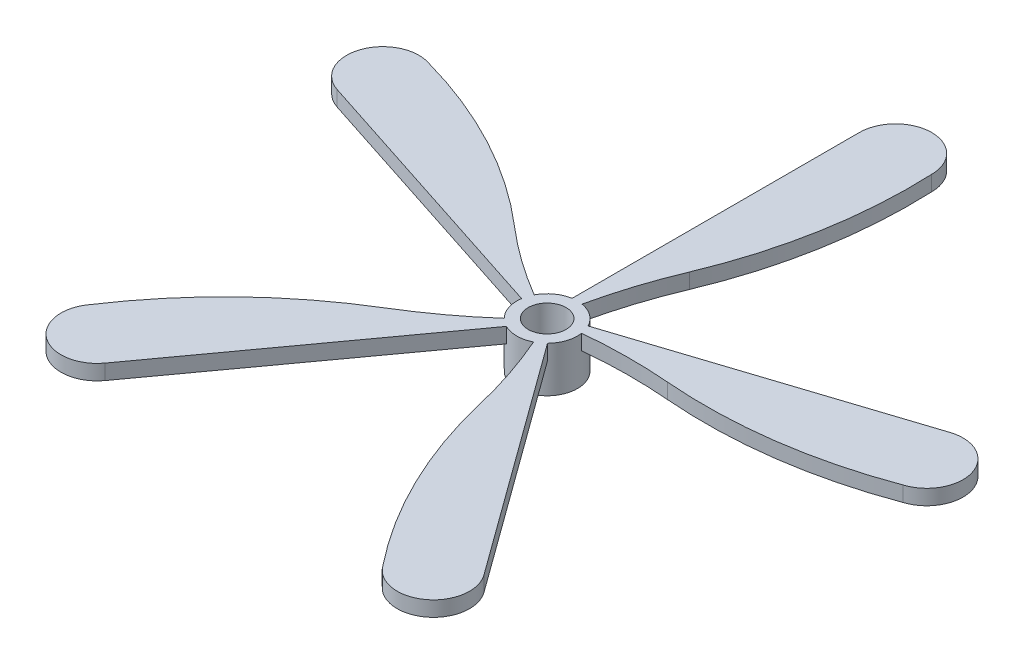
ISO-10303-21;
HEADER;
FILE_DESCRIPTION(('STEP AP214'),'2;1');
FILE_NAME('part.step','',(''),(''),'','','');
FILE_SCHEMA(('AUTOMOTIVE_DESIGN { 1 0 10303 214 1 1 1 1 }'));
ENDSEC;
DATA;
#1=APPLICATION_CONTEXT('core data for automotive mechanical design processes');
#2=APPLICATION_PROTOCOL_DEFINITION('international standard','automotive_design',2000,#1);
#3=PRODUCT_CONTEXT('',#1,'mechanical');
#4=PRODUCT('Part','Part','',(#3));
#5=PRODUCT_RELATED_PRODUCT_CATEGORY('part','',(#4));
#6=PRODUCT_DEFINITION_FORMATION('','',#4);
#7=PRODUCT_DEFINITION_CONTEXT('part definition',#1,'design');
#8=PRODUCT_DEFINITION('design','',#6,#7);
#9=PRODUCT_DEFINITION_SHAPE('','',#8);
#10=(LENGTH_UNIT() NAMED_UNIT(*) SI_UNIT(.MILLI.,.METRE.));
#11=(NAMED_UNIT(*) PLANE_ANGLE_UNIT() SI_UNIT($,.RADIAN.));
#12=(NAMED_UNIT(*) SI_UNIT($,.STERADIAN.) SOLID_ANGLE_UNIT());
#13=UNCERTAINTY_MEASURE_WITH_UNIT(LENGTH_MEASURE(1.E-05),#10,'distance_accuracy_value','');
#14=(GEOMETRIC_REPRESENTATION_CONTEXT(3) GLOBAL_UNCERTAINTY_ASSIGNED_CONTEXT((#13)) GLOBAL_UNIT_ASSIGNED_CONTEXT((#10,
#11,#12)) REPRESENTATION_CONTEXT('',''));
#15=CARTESIAN_POINT('',(0.,0.,0.));
#16=DIRECTION('',(0.,0.,1.));
#17=DIRECTION('',(1.,0.,0.));
#18=AXIS2_PLACEMENT_3D('',#15,#16,#17);
#19=CARTESIAN_POINT('',(0.,6.,0.));
#20=DIRECTION('',(0.,1.,0.));
#21=DIRECTION('',(0.,0.,1.));
#22=AXIS2_PLACEMENT_3D('',#19,#20,#21);
#23=PLANE('',#22);
#24=CARTESIAN_POINT('',(0.,6.,0.));
#25=DIRECTION('',(0.,1.,0.));
#26=DIRECTION('',(0.,0.,1.));
#27=AXIS2_PLACEMENT_3D('',#24,#25,#26);
#28=CIRCLE('',#27,4.);
#29=CARTESIAN_POINT('',(-0.65939763403977,6.,-3.94527499171132));
#30=VERTEX_POINT('',#29);
#31=CARTESIAN_POINT('',(-3.54841441447447,6.,-1.84628143660442));
#32=VERTEX_POINT('',#31);
#33=EDGE_CURVE('E11',#30,#32,#28,.T.);
#34=ORIENTED_EDGE('',*,*,#33,.T.);
#35=CARTESIAN_POINT('',(28.3133843807935,6.,-56.0535189617513));
#36=DIRECTION('',(0.,-1.,0.));
#37=DIRECTION('',(0.951056516295155,0.,0.309016994374945));
#38=AXIS2_PLACEMENT_3D('',#35,#36,#37);
#39=CIRCLE('',#38,62.8776496266983);
#40=CARTESIAN_POINT('',(-12.7002363605592,6.,-8.39345458640333));
#41=VERTEX_POINT('',#40);
#42=EDGE_CURVE('E315',#32,#41,#39,.T.);
#43=ORIENTED_EDGE('',*,*,#42,.T.);
#44=CARTESIAN_POINT('',(-53.78297853576,6.,39.346932665281));
#45=DIRECTION('',(0.,1.,0.));
#46=DIRECTION('',(-0.951056516295155,0.,-0.309016994374945));
#47=AXIS2_PLACEMENT_3D('',#44,#45,#46);
#48=CIRCLE('',#47,62.9836191368423);
#49=CARTESIAN_POINT('',(-36.9640956294667,6.,-21.349537226791));
#50=VERTEX_POINT('',#49);
#51=EDGE_CURVE('E343',#41,#50,#48,.T.);
#52=ORIENTED_EDGE('',*,*,#51,.T.);
#53=CARTESIAN_POINT('',(-38.4873725052939,6.,-16.8283735232392));
#54=DIRECTION('',(0.,1.,0.));
#55=DIRECTION('',(-0.951056516295155,0.,-0.309016994374945));
#56=AXIS2_PLACEMENT_3D('',#53,#54,#55);
#57=CIRCLE('',#56,4.7708797589904);
#58=CARTESIAN_POINT('',(-39.9616554289414,6.,-12.2909972399907));
#59=VERTEX_POINT('',#58);
#60=EDGE_CURVE('E346',#50,#59,#57,.T.);
#61=ORIENTED_EDGE('',*,*,#60,.T.);
#62=DIRECTION('',(0.951056516295155,0.,0.309016994374945));
#63=VECTOR('',#62,1.);
#64=CARTESIAN_POINT('',(-3.95594456441228,6.,-0.592032603238136));
#65=LINE('',#64,#63);
#66=CARTESIAN_POINT('',(-3.95594456441228,6.,-0.592032603238136));
#67=VERTEX_POINT('',#66);
#68=EDGE_CURVE('E328',#59,#67,#65,.T.);
#69=ORIENTED_EDGE('',*,*,#68,.T.);
#70=CARTESIAN_POINT('',(-2.85243834835505,6.,2.80421031109185));
#71=VERTEX_POINT('',#70);
#72=EDGE_CURVE('E42',#67,#71,#28,.T.);
#73=ORIENTED_EDGE('',*,*,#72,.T.);
#74=CARTESIAN_POINT('',(-44.5607475279122,6.,-44.2491186674225));
#75=DIRECTION('',(0.,-1.,0.));
#76=DIRECTION('',(0.587785252292469,0.,-0.809016994374951));
#77=AXIS2_PLACEMENT_3D('',#74,#75,#76);
#78=CIRCLE('',#77,62.8776496266983);
#79=CARTESIAN_POINT('',(-11.9072385466177,6.,9.48492244048556));
#80=VERTEX_POINT('',#79);
#81=EDGE_CURVE('E277',#71,#80,#78,.T.);
#82=ORIENTED_EDGE('',*,*,#81,.T.);
#83=CARTESIAN_POINT('',(20.8013023318894,6.,63.3095230722955));
#84=DIRECTION('',(0.,1.,0.));
#85=DIRECTION('',(-0.587785252292469,0.,0.809016994374951));
#86=AXIS2_PLACEMENT_3D('',#83,#84,#85);
#87=CIRCLE('',#86,62.9836191368423);
#88=CARTESIAN_POINT('',(-31.7271502306314,6.,28.5575741922426));
#89=VERTEX_POINT('',#88);
#90=EDGE_CURVE('E305',#80,#89,#87,.T.);
#91=ORIENTED_EDGE('',*,*,#90,.T.);
#92=CARTESIAN_POINT('',(-27.8979864709003,6.,31.4034130098685));
#93=DIRECTION('',(0.,1.,0.));
#94=DIRECTION('',(-0.587785252292469,0.,0.809016994374951));
#95=AXIS2_PLACEMENT_3D('',#92,#93,#94);
#96=CIRCLE('',#95,4.7708797589904);
#97=CARTESIAN_POINT('',(-24.0382636677576,6.,34.2076657726637));
#98=VERTEX_POINT('',#97);
#99=EDGE_CURVE('E308',#89,#98,#96,.T.);
#100=ORIENTED_EDGE('',*,*,#99,.T.);
#101=DIRECTION('',(0.587785252292469,0.,-0.809016994374951));
#102=VECTOR('',#101,1.);
#103=CARTESIAN_POINT('',(-1.7855105643774,6.,3.57937872046207));
#104=LINE('',#103,#102);
#105=CARTESIAN_POINT('',(-1.7855105643774,6.,3.57937872046207));
#106=VERTEX_POINT('',#105);
#107=EDGE_CURVE('E290',#98,#106,#104,.T.);
#108=ORIENTED_EDGE('',*,*,#107,.T.);
#109=CARTESIAN_POINT('',(1.78551056437746,6.,3.57937872046209));
#110=VERTEX_POINT('',#109);
#111=EDGE_CURVE('E451',#106,#110,#28,.T.);
#112=ORIENTED_EDGE('',*,*,#111,.T.);
#113=CARTESIAN_POINT('',(-55.8534409171459,6.,28.706059653057));
#114=DIRECTION('',(0.,-1.,0.));
#115=DIRECTION('',(-0.58778525229248,0.,-0.809016994374942));
#116=AXIS2_PLACEMENT_3D('',#113,#114,#115);
#117=CIRCLE('',#116,62.8776496266983);
#118=CARTESIAN_POINT('',(5.34115822659664,6.,14.25545903528));
#119=VERTEX_POINT('',#118);
#120=EDGE_CURVE('E245',#110,#119,#117,.T.);
#121=ORIENTED_EDGE('',*,*,#120,.T.);
#122=CARTESIAN_POINT('',(66.63889038713,6.,-0.21949559505708));
#123=DIRECTION('',(0.,1.,0.));
#124=DIRECTION('',(0.58778525229248,0.,0.809016994374942));
#125=AXIS2_PLACEMENT_3D('',#122,#123,#124);
#126=CIRCLE('',#125,62.9836191368423);
#127=CARTESIAN_POINT('',(17.3556384207626,6.,38.9990887138436));
#128=VERTEX_POINT('',#127);
#129=EDGE_CURVE('E269',#119,#128,#126,.T.);
#130=ORIENTED_EDGE('',*,*,#129,.T.);
#131=CARTESIAN_POINT('',(21.245468648593,6.,36.2367501260883));
#132=DIRECTION('',(0.,1.,0.));
#133=DIRECTION('',(0.58778525229248,0.,0.809016994374942));
#134=AXIS2_PLACEMENT_3D('',#131,#132,#133);
#135=CIRCLE('',#134,4.7708797589904);
#136=CARTESIAN_POINT('',(25.1051914517357,6.,33.4324973632931));
#137=VERTEX_POINT('',#136);
#138=EDGE_CURVE('E272',#128,#137,#135,.T.);
#139=ORIENTED_EDGE('',*,*,#138,.T.);
#140=DIRECTION('',(-0.58778525229248,0.,-0.809016994374942));
#141=VECTOR('',#140,1.);
#142=CARTESIAN_POINT('',(2.85243834835505,6.,2.80421031109179));
#143=LINE('',#142,#141);
#144=CARTESIAN_POINT('',(2.85243834835505,6.,2.80421031109179));
#145=VERTEX_POINT('',#144);
#146=EDGE_CURVE('E57',#137,#145,#143,.T.);
#147=ORIENTED_EDGE('',*,*,#146,.T.);
#148=CARTESIAN_POINT('',(3.95594456441231,6.,-0.59203260323819));
#149=VERTEX_POINT('',#148);
#150=EDGE_CURVE('E453',#145,#149,#28,.T.);
#151=ORIENTED_EDGE('',*,*,#150,.T.);
#152=CARTESIAN_POINT('',(10.0414226524823,6.,61.9904392160935));
#153=DIRECTION('',(0.,-1.,0.));
#154=DIRECTION('',(-0.95105651629515,0.,0.309016994374958));
#155=AXIS2_PLACEMENT_3D('',#152,#153,#154);
#156=CIRCLE('',#155,62.8776496266983);
#157=CARTESIAN_POINT('',(15.2082558699455,6.,-0.67456423145084));
#158=VERTEX_POINT('',#157);
#159=EDGE_CURVE('E209',#149,#158,#156,.T.);
#160=ORIENTED_EDGE('',*,*,#159,.T.);
#161=CARTESIAN_POINT('',(20.3837968999352,6.,-63.4451788104216));
#162=DIRECTION('',(0.,1.,0.));
#163=DIRECTION('',(0.95105651629515,0.,-0.309016994374958));
#164=AXIS2_PLACEMENT_3D('',#161,#162,#163);
#165=CIRCLE('',#164,62.9836191368423);
#166=CARTESIAN_POINT('',(42.4535246711162,6.,-4.45481183681507));
#167=VERTEX_POINT('',#166);
#168=EDGE_CURVE('E240',#158,#167,#165,.T.);
#169=ORIENTED_EDGE('',*,*,#168,.T.);
#170=CARTESIAN_POINT('',(41.0284082026509,6.,-9.00786979010904));
#171=DIRECTION('',(0.,1.,0.));
#172=DIRECTION('',(0.95105651629515,0.,-0.309016994374958));
#173=AXIS2_PLACEMENT_3D('',#170,#171,#172);
#174=CIRCLE('',#173,4.7708797589904);
#175=CARTESIAN_POINT('',(39.5541252790034,6.,-13.5452460733575));
#176=VERTEX_POINT('',#175);
#177=EDGE_CURVE('E231',#167,#176,#174,.T.);
#178=ORIENTED_EDGE('',*,*,#177,.T.);
#179=DIRECTION('',(-0.95105651629515,0.,0.309016994374958));
#180=VECTOR('',#179,1.);
#181=CARTESIAN_POINT('',(3.54841441447442,6.,-1.84628143660445));
#182=LINE('',#181,#180);
#183=CARTESIAN_POINT('',(3.54841441447442,6.,-1.84628143660445));
#184=VERTEX_POINT('',#183);
#185=EDGE_CURVE('E50',#176,#184,#182,.T.);
#186=ORIENTED_EDGE('',*,*,#185,.T.);
#187=CARTESIAN_POINT('',(0.659397634039785,6.,-3.94527499171136));
#188=VERTEX_POINT('',#187);
#189=EDGE_CURVE('E43',#184,#188,#28,.T.);
#190=ORIENTED_EDGE('',*,*,#189,.T.);
#191=CARTESIAN_POINT('',(62.0593814117829,6.,9.60613876002377));
#192=DIRECTION('',(0.,-1.,0.));
#193=DIRECTION('',(0.,0.,1.));
#194=AXIS2_PLACEMENT_3D('',#191,#192,#193);
#195=CIRCLE('',#194,62.8776496266983);
#196=CARTESIAN_POINT('',(4.05806081063494,6.,-14.6723626579115));
#197=VERTEX_POINT('',#196);
#198=EDGE_CURVE('E353',#188,#197,#195,.T.);
#199=ORIENTED_EDGE('',*,*,#198,.T.);
#200=CARTESIAN_POINT('',(-54.0410110831949,6.,-38.9917813320985));
#201=DIRECTION('',(0.,1.,0.));
#202=DIRECTION('',(0.,0.,-1.));
#203=AXIS2_PLACEMENT_3D('',#200,#201,#202);
#204=CIRCLE('',#203,62.9836191368423);
#205=CARTESIAN_POINT('',(8.88208276821971,6.,-41.7523138424805));
#206=VERTEX_POINT('',#205);
#207=EDGE_CURVE('E381',#197,#206,#204,.T.);
#208=ORIENTED_EDGE('',*,*,#207,.T.);
#209=CARTESIAN_POINT('',(4.11148212495063,6.,-41.803919822609));
#210=DIRECTION('',(0.,1.,0.));
#211=DIRECTION('',(0.,0.,-1.));
#212=AXIS2_PLACEMENT_3D('',#209,#210,#211);
#213=CIRCLE('',#212,4.7708797589904);
#214=CARTESIAN_POINT('',(-0.65939763403977,6.,-41.803919822609));
#215=VERTEX_POINT('',#214);
#216=EDGE_CURVE('E384',#206,#215,#213,.T.);
#217=ORIENTED_EDGE('',*,*,#216,.T.);
#218=DIRECTION('',(0.,0.,1.));
#219=VECTOR('',#218,1.);
#220=CARTESIAN_POINT('',(-0.65939763403977,6.,-3.94527499171132));
#221=LINE('',#220,#219);
#222=EDGE_CURVE('E366',#215,#30,#221,.T.);
#223=ORIENTED_EDGE('',*,*,#222,.T.);
#224=EDGE_LOOP('',(#34,#43,#52,#61,#69,#73,#82,#91,#100,#108,#112,#121,#130,#139,#147,#151,#160,
#169,#178,#186,#190,#199,#208,#217,#223));
#225=FACE_BOUND('',#224,.T.);
#226=CARTESIAN_POINT('',(0.,6.,0.));
#227=DIRECTION('',(0.,1.,0.));
#228=DIRECTION('',(0.,0.,1.));
#229=AXIS2_PLACEMENT_3D('',#226,#227,#228);
#230=CIRCLE('',#229,2.5);
#231=CARTESIAN_POINT('',(0.,6.,2.5));
#232=VERTEX_POINT('',#231);
#233=EDGE_CURVE('E400',#232,#232,#230,.T.);
#234=ORIENTED_EDGE('',*,*,#233,.F.);
#235=EDGE_LOOP('',(#234));
#236=FACE_BOUND('',#235,.T.);
#237=ADVANCED_FACE('F33',(#225,#236),#23,.T.);
#238=CARTESIAN_POINT('',(0.,0.,0.));
#239=DIRECTION('',(0.,1.,0.));
#240=DIRECTION('',(0.,0.,1.));
#241=AXIS2_PLACEMENT_3D('',#238,#239,#240);
#242=PLANE('',#241);
#243=CARTESIAN_POINT('',(0.,0.,0.));
#244=DIRECTION('',(0.,1.,0.));
#245=DIRECTION('',(0.,0.,1.));
#246=AXIS2_PLACEMENT_3D('',#243,#244,#245);
#247=CIRCLE('',#246,4.);
#248=CARTESIAN_POINT('',(0.,0.,4.));
#249=VERTEX_POINT('',#248);
#250=EDGE_CURVE('E37',#249,#249,#247,.T.);
#251=ORIENTED_EDGE('',*,*,#250,.F.);
#252=EDGE_LOOP('',(#251));
#253=FACE_BOUND('',#252,.T.);
#254=CARTESIAN_POINT('',(0.,0.,0.));
#255=DIRECTION('',(0.,1.,0.));
#256=DIRECTION('',(0.,0.,1.));
#257=AXIS2_PLACEMENT_3D('',#254,#255,#256);
#258=CIRCLE('',#257,2.5);
#259=CARTESIAN_POINT('',(0.,0.,2.5));
#260=VERTEX_POINT('',#259);
#261=EDGE_CURVE('E391',#260,#260,#258,.T.);
#262=ORIENTED_EDGE('',*,*,#261,.T.);
#263=EDGE_LOOP('',(#262));
#264=FACE_BOUND('',#263,.T.);
#265=ADVANCED_FACE('F406',(#253,#264),#242,.F.);
#266=CARTESIAN_POINT('',(0.,6.,0.));
#267=DIRECTION('',(0.,-1.,0.));
#268=DIRECTION('',(0.,0.,-1.));
#269=AXIS2_PLACEMENT_3D('',#266,#267,#268);
#270=CYLINDRICAL_SURFACE('',#269,4.);
#271=ORIENTED_EDGE('',*,*,#189,.F.);
#272=DIRECTION('',(0.,1.,0.));
#273=VECTOR('',#272,1.);
#274=CARTESIAN_POINT('',(3.54841441447442,4.,-1.84628143660445));
#275=LINE('',#274,#273);
#276=CARTESIAN_POINT('',(3.54841441447442,4.,-1.84628143660445));
#277=VERTEX_POINT('',#276);
#278=EDGE_CURVE('E229',#277,#184,#275,.T.);
#279=ORIENTED_EDGE('',*,*,#278,.F.);
#280=CARTESIAN_POINT('',(0.,4.,0.));
#281=DIRECTION('',(0.,-1.,0.));
#282=DIRECTION('',(-0.95105651629515,0.,0.309016994374958));
#283=AXIS2_PLACEMENT_3D('',#280,#281,#282);
#284=CIRCLE('',#283,4.);
#285=CARTESIAN_POINT('',(3.95594456441231,4.,-0.59203260323819));
#286=VERTEX_POINT('',#285);
#287=EDGE_CURVE('E220',#277,#286,#284,.T.);
#288=ORIENTED_EDGE('',*,*,#287,.T.);
#289=DIRECTION('',(0.,1.,0.));
#290=VECTOR('',#289,1.);
#291=CARTESIAN_POINT('',(3.95594456441231,4.,-0.59203260323819));
#292=LINE('',#291,#290);
#293=EDGE_CURVE('E204',#286,#149,#292,.T.);
#294=ORIENTED_EDGE('',*,*,#293,.T.);
#295=ORIENTED_EDGE('',*,*,#150,.F.);
#296=DIRECTION('',(0.,1.,0.));
#297=VECTOR('',#296,1.);
#298=CARTESIAN_POINT('',(2.85243834835505,4.,2.80421031109179));
#299=LINE('',#298,#297);
#300=CARTESIAN_POINT('',(2.85243834835505,4.,2.80421031109179));
#301=VERTEX_POINT('',#300);
#302=EDGE_CURVE('E275',#301,#145,#299,.T.);
#303=ORIENTED_EDGE('',*,*,#302,.F.);
#304=CARTESIAN_POINT('',(0.,4.,0.));
#305=DIRECTION('',(0.,-1.,0.));
#306=DIRECTION('',(-0.58778525229248,0.,-0.809016994374942));
#307=AXIS2_PLACEMENT_3D('',#304,#305,#306);
#308=CIRCLE('',#307,4.);
#309=CARTESIAN_POINT('',(1.78551056437746,4.,3.57937872046209));
#310=VERTEX_POINT('',#309);
#311=EDGE_CURVE('E251',#301,#310,#308,.T.);
#312=ORIENTED_EDGE('',*,*,#311,.T.);
#313=DIRECTION('',(0.,1.,0.));
#314=VECTOR('',#313,1.);
#315=CARTESIAN_POINT('',(1.78551056437746,4.,3.57937872046209));
#316=LINE('',#315,#314);
#317=EDGE_CURVE('E266',#310,#110,#316,.T.);
#318=ORIENTED_EDGE('',*,*,#317,.T.);
#319=ORIENTED_EDGE('',*,*,#111,.F.);
#320=DIRECTION('',(0.,1.,0.));
#321=VECTOR('',#320,1.);
#322=CARTESIAN_POINT('',(-1.7855105643774,4.,3.57937872046207));
#323=LINE('',#322,#321);
#324=CARTESIAN_POINT('',(-1.7855105643774,4.,3.57937872046207));
#325=VERTEX_POINT('',#324);
#326=EDGE_CURVE('E312',#325,#106,#323,.T.);
#327=ORIENTED_EDGE('',*,*,#326,.F.);
#328=CARTESIAN_POINT('',(0.,4.,0.));
#329=DIRECTION('',(0.,-1.,0.));
#330=DIRECTION('',(0.587785252292469,0.,-0.809016994374951));
#331=AXIS2_PLACEMENT_3D('',#328,#329,#330);
#332=CIRCLE('',#331,4.);
#333=CARTESIAN_POINT('',(-2.85243834835505,4.,2.80421031109185));
#334=VERTEX_POINT('',#333);
#335=EDGE_CURVE('E286',#325,#334,#332,.T.);
#336=ORIENTED_EDGE('',*,*,#335,.T.);
#337=DIRECTION('',(0.,1.,0.));
#338=VECTOR('',#337,1.);
#339=CARTESIAN_POINT('',(-2.85243834835505,4.,2.80421031109185));
#340=LINE('',#339,#338);
#341=EDGE_CURVE('E302',#334,#71,#340,.T.);
#342=ORIENTED_EDGE('',*,*,#341,.T.);
#343=ORIENTED_EDGE('',*,*,#72,.F.);
#344=DIRECTION('',(0.,1.,0.));
#345=VECTOR('',#344,1.);
#346=CARTESIAN_POINT('',(-3.95594456441228,4.,-0.592032603238136));
#347=LINE('',#346,#345);
#348=CARTESIAN_POINT('',(-3.95594456441228,4.,-0.592032603238136));
#349=VERTEX_POINT('',#348);
#350=EDGE_CURVE('E350',#349,#67,#347,.T.);
#351=ORIENTED_EDGE('',*,*,#350,.F.);
#352=CARTESIAN_POINT('',(0.,4.,0.));
#353=DIRECTION('',(0.,-1.,0.));
#354=DIRECTION('',(0.951056516295155,0.,0.309016994374945));
#355=AXIS2_PLACEMENT_3D('',#352,#353,#354);
#356=CIRCLE('',#355,4.);
#357=CARTESIAN_POINT('',(-3.54841441447447,4.,-1.84628143660442));
#358=VERTEX_POINT('',#357);
#359=EDGE_CURVE('E324',#349,#358,#356,.T.);
#360=ORIENTED_EDGE('',*,*,#359,.T.);
#361=DIRECTION('',(0.,1.,0.));
#362=VECTOR('',#361,1.);
#363=CARTESIAN_POINT('',(-3.54841441447447,4.,-1.84628143660442));
#364=LINE('',#363,#362);
#365=EDGE_CURVE('E340',#358,#32,#364,.T.);
#366=ORIENTED_EDGE('',*,*,#365,.T.);
#367=ORIENTED_EDGE('',*,*,#33,.F.);
#368=DIRECTION('',(0.,1.,0.));
#369=VECTOR('',#368,1.);
#370=CARTESIAN_POINT('',(-0.65939763403977,4.,-3.94527499171132));
#371=LINE('',#370,#369);
#372=CARTESIAN_POINT('',(-0.65939763403977,4.,-3.94527499171132));
#373=VERTEX_POINT('',#372);
#374=EDGE_CURVE('E388',#373,#30,#371,.T.);
#375=ORIENTED_EDGE('',*,*,#374,.F.);
#376=CARTESIAN_POINT('',(0.,4.,0.));
#377=DIRECTION('',(0.,-1.,0.));
#378=DIRECTION('',(0.,0.,1.));
#379=AXIS2_PLACEMENT_3D('',#376,#377,#378);
#380=CIRCLE('',#379,4.);
#381=CARTESIAN_POINT('',(0.659397634039785,4.,-3.94527499171136));
#382=VERTEX_POINT('',#381);
#383=EDGE_CURVE('E362',#373,#382,#380,.T.);
#384=ORIENTED_EDGE('',*,*,#383,.T.);
#385=DIRECTION('',(0.,1.,0.));
#386=VECTOR('',#385,1.);
#387=CARTESIAN_POINT('',(0.659397634039785,4.,-3.94527499171136));
#388=LINE('',#387,#386);
#389=EDGE_CURVE('E378',#382,#188,#388,.T.);
#390=ORIENTED_EDGE('',*,*,#389,.T.);
#391=EDGE_LOOP('',(#271,#279,#288,#294,#295,#303,#312,#318,#319,#327,#336,#342,#343,#351,#360,
#366,#367,#375,#384,#390));
#392=FACE_BOUND('',#391,.T.);
#393=ORIENTED_EDGE('',*,*,#250,.T.);
#394=EDGE_LOOP('',(#393));
#395=FACE_BOUND('',#394,.T.);
#396=ADVANCED_FACE('F35',(#392,#395),#270,.T.);
#397=CARTESIAN_POINT('',(0.,6.,0.));
#398=DIRECTION('',(0.,-1.,0.));
#399=DIRECTION('',(0.,0.,-1.));
#400=AXIS2_PLACEMENT_3D('',#397,#398,#399);
#401=CYLINDRICAL_SURFACE('',#400,2.5);
#402=ORIENTED_EDGE('',*,*,#233,.T.);
#403=EDGE_LOOP('',(#402));
#404=FACE_BOUND('',#403,.T.);
#405=ORIENTED_EDGE('',*,*,#261,.F.);
#406=EDGE_LOOP('',(#405));
#407=FACE_BOUND('',#406,.T.);
#408=ADVANCED_FACE('F408',(#404,#407),#401,.F.);
#409=CARTESIAN_POINT('',(-0.65939763403977,4.,-3.94527499171132));
#410=DIRECTION('',(-1.,0.,0.));
#411=DIRECTION('',(0.,0.,1.));
#412=AXIS2_PLACEMENT_3D('',#409,#410,#411);
#413=PLANE('',#412);
#414=ORIENTED_EDGE('',*,*,#222,.F.);
#415=DIRECTION('',(0.,1.,0.));
#416=VECTOR('',#415,1.);
#417=CARTESIAN_POINT('',(-0.65939763403977,4.,-41.803919822609));
#418=LINE('',#417,#416);
#419=CARTESIAN_POINT('',(-0.65939763403977,4.,-41.803919822609));
#420=VERTEX_POINT('',#419);
#421=EDGE_CURVE('E392',#420,#215,#418,.T.);
#422=ORIENTED_EDGE('',*,*,#421,.F.);
#423=DIRECTION('',(0.,0.,1.));
#424=VECTOR('',#423,1.);
#425=CARTESIAN_POINT('',(-0.65939763403977,4.,-3.94527499171132));
#426=LINE('',#425,#424);
#427=EDGE_CURVE('E375',#420,#373,#426,.T.);
#428=ORIENTED_EDGE('',*,*,#427,.T.);
#429=ORIENTED_EDGE('',*,*,#374,.T.);
#430=EDGE_LOOP('',(#414,#422,#428,#429));
#431=FACE_BOUND('',#430,.T.);
#432=ADVANCED_FACE('F410',(#431),#413,.T.);
#433=CARTESIAN_POINT('',(4.11148212495063,4.,-41.803919822609));
#434=DIRECTION('',(0.,1.,0.));
#435=DIRECTION('',(0.,0.,1.));
#436=AXIS2_PLACEMENT_3D('',#433,#434,#435);
#437=CYLINDRICAL_SURFACE('',#436,4.7708797589904);
#438=ORIENTED_EDGE('',*,*,#216,.F.);
#439=DIRECTION('',(0.,1.,0.));
#440=VECTOR('',#439,1.);
#441=CARTESIAN_POINT('',(8.88208276821971,4.,-41.7523138424805));
#442=LINE('',#441,#440);
#443=CARTESIAN_POINT('',(8.88208276821971,4.,-41.7523138424805));
#444=VERTEX_POINT('',#443);
#445=EDGE_CURVE('E394',#444,#206,#442,.T.);
#446=ORIENTED_EDGE('',*,*,#445,.F.);
#447=CARTESIAN_POINT('',(4.11148212495063,4.,-41.803919822609));
#448=DIRECTION('',(0.,1.,0.));
#449=DIRECTION('',(0.,0.,-1.));
#450=AXIS2_PLACEMENT_3D('',#447,#448,#449);
#451=CIRCLE('',#450,4.7708797589904);
#452=EDGE_CURVE('E372',#444,#420,#451,.T.);
#453=ORIENTED_EDGE('',*,*,#452,.T.);
#454=ORIENTED_EDGE('',*,*,#421,.T.);
#455=EDGE_LOOP('',(#438,#446,#453,#454));
#456=FACE_BOUND('',#455,.T.);
#457=ADVANCED_FACE('F417',(#456),#437,.T.);
#458=CARTESIAN_POINT('',(-54.0410110831949,4.,-38.9917813320985));
#459=DIRECTION('',(0.,1.,0.));
#460=DIRECTION('',(0.,0.,1.));
#461=AXIS2_PLACEMENT_3D('',#458,#459,#460);
#462=CYLINDRICAL_SURFACE('',#461,62.9836191368423);
#463=ORIENTED_EDGE('',*,*,#207,.F.);
#464=DIRECTION('',(0.,1.,0.));
#465=VECTOR('',#464,1.);
#466=CARTESIAN_POINT('',(4.05806081063494,4.,-14.6723626579115));
#467=LINE('',#466,#465);
#468=CARTESIAN_POINT('',(4.05806081063494,4.,-14.6723626579115));
#469=VERTEX_POINT('',#468);
#470=EDGE_CURVE('E396',#469,#197,#467,.T.);
#471=ORIENTED_EDGE('',*,*,#470,.F.);
#472=CARTESIAN_POINT('',(-54.0410110831949,4.,-38.9917813320985));
#473=DIRECTION('',(0.,1.,0.));
#474=DIRECTION('',(0.,0.,-1.));
#475=AXIS2_PLACEMENT_3D('',#472,#473,#474);
#476=CIRCLE('',#475,62.9836191368423);
#477=EDGE_CURVE('E369',#469,#444,#476,.T.);
#478=ORIENTED_EDGE('',*,*,#477,.T.);
#479=ORIENTED_EDGE('',*,*,#445,.T.);
#480=EDGE_LOOP('',(#463,#471,#478,#479));
#481=FACE_BOUND('',#480,.T.);
#482=ADVANCED_FACE('F470',(#481),#462,.T.);
#483=CARTESIAN_POINT('',(62.0593814117829,4.,9.60613876002377));
#484=DIRECTION('',(0.,1.,0.));
#485=DIRECTION('',(0.,0.,1.));
#486=AXIS2_PLACEMENT_3D('',#483,#484,#485);
#487=CYLINDRICAL_SURFACE('',#486,62.8776496266983);
#488=ORIENTED_EDGE('',*,*,#198,.F.);
#489=ORIENTED_EDGE('',*,*,#389,.F.);
#490=CARTESIAN_POINT('',(62.0593814117829,4.,9.60613876002377));
#491=DIRECTION('',(0.,-1.,0.));
#492=DIRECTION('',(0.,0.,1.));
#493=AXIS2_PLACEMENT_3D('',#490,#491,#492);
#494=CIRCLE('',#493,62.8776496266983);
#495=EDGE_CURVE('E365',#382,#469,#494,.T.);
#496=ORIENTED_EDGE('',*,*,#495,.T.);
#497=ORIENTED_EDGE('',*,*,#470,.T.);
#498=EDGE_LOOP('',(#488,#489,#496,#497));
#499=FACE_BOUND('',#498,.T.);
#500=ADVANCED_FACE('F459',(#499),#487,.F.);
#501=CARTESIAN_POINT('',(0.,4.,0.));
#502=DIRECTION('',(0.,1.,0.));
#503=DIRECTION('',(0.,0.,1.));
#504=AXIS2_PLACEMENT_3D('',#501,#502,#503);
#505=PLANE('',#504);
#506=ORIENTED_EDGE('',*,*,#383,.F.);
#507=ORIENTED_EDGE('',*,*,#427,.F.);
#508=ORIENTED_EDGE('',*,*,#452,.F.);
#509=ORIENTED_EDGE('',*,*,#477,.F.);
#510=ORIENTED_EDGE('',*,*,#495,.F.);
#511=EDGE_LOOP('',(#506,#507,#508,#509,#510));
#512=FACE_BOUND('',#511,.T.);
#513=ADVANCED_FACE('F464',(#512),#505,.F.);
#514=CARTESIAN_POINT('',(-3.95594456441228,4.,-0.592032603238136));
#515=DIRECTION('',(-0.309016994374945,0.,0.951056516295154));
#516=DIRECTION('',(0.951056516295155,0.,0.309016994374945));
#517=AXIS2_PLACEMENT_3D('',#514,#515,#516);
#518=PLANE('',#517);
#519=ORIENTED_EDGE('',*,*,#68,.F.);
#520=DIRECTION('',(0.,1.,0.));
#521=VECTOR('',#520,1.);
#522=CARTESIAN_POINT('',(-39.9616554289414,4.,-12.2909972399907));
#523=LINE('',#522,#521);
#524=CARTESIAN_POINT('',(-39.9616554289414,4.,-12.2909972399907));
#525=VERTEX_POINT('',#524);
#526=EDGE_CURVE('E354',#525,#59,#523,.T.);
#527=ORIENTED_EDGE('',*,*,#526,.F.);
#528=DIRECTION('',(0.951056516295155,0.,0.309016994374945));
#529=VECTOR('',#528,1.);
#530=CARTESIAN_POINT('',(-3.95594456441228,4.,-0.592032603238136));
#531=LINE('',#530,#529);
#532=EDGE_CURVE('E337',#525,#349,#531,.T.);
#533=ORIENTED_EDGE('',*,*,#532,.T.);
#534=ORIENTED_EDGE('',*,*,#350,.T.);
#535=EDGE_LOOP('',(#519,#527,#533,#534));
#536=FACE_BOUND('',#535,.T.);
#537=ADVANCED_FACE('F449',(#536),#518,.T.);
#538=CARTESIAN_POINT('',(-38.4873725052939,4.,-16.8283735232392));
#539=DIRECTION('',(0.,1.,0.));
#540=DIRECTION('',(0.,0.,1.));
#541=AXIS2_PLACEMENT_3D('',#538,#539,#540);
#542=CYLINDRICAL_SURFACE('',#541,4.7708797589904);
#543=ORIENTED_EDGE('',*,*,#60,.F.);
#544=DIRECTION('',(0.,1.,0.));
#545=VECTOR('',#544,1.);
#546=CARTESIAN_POINT('',(-36.9640956294667,4.,-21.349537226791));
#547=LINE('',#546,#545);
#548=CARTESIAN_POINT('',(-36.9640956294667,4.,-21.349537226791));
#549=VERTEX_POINT('',#548);
#550=EDGE_CURVE('E356',#549,#50,#547,.T.);
#551=ORIENTED_EDGE('',*,*,#550,.F.);
#552=CARTESIAN_POINT('',(-38.4873725052939,4.,-16.8283735232392));
#553=DIRECTION('',(0.,1.,0.));
#554=DIRECTION('',(-0.951056516295155,0.,-0.309016994374945));
#555=AXIS2_PLACEMENT_3D('',#552,#553,#554);
#556=CIRCLE('',#555,4.7708797589904);
#557=EDGE_CURVE('E334',#549,#525,#556,.T.);
#558=ORIENTED_EDGE('',*,*,#557,.T.);
#559=ORIENTED_EDGE('',*,*,#526,.T.);
#560=EDGE_LOOP('',(#543,#551,#558,#559));
#561=FACE_BOUND('',#560,.T.);
#562=ADVANCED_FACE('F485',(#561),#542,.T.);
#563=CARTESIAN_POINT('',(-53.78297853576,4.,39.346932665281));
#564=DIRECTION('',(0.,1.,0.));
#565=DIRECTION('',(0.,0.,1.));
#566=AXIS2_PLACEMENT_3D('',#563,#564,#565);
#567=CYLINDRICAL_SURFACE('',#566,62.9836191368423);
#568=ORIENTED_EDGE('',*,*,#51,.F.);
#569=DIRECTION('',(0.,1.,0.));
#570=VECTOR('',#569,1.);
#571=CARTESIAN_POINT('',(-12.7002363605592,4.,-8.39345458640333));
#572=LINE('',#571,#570);
#573=CARTESIAN_POINT('',(-12.7002363605592,4.,-8.39345458640333));
#574=VERTEX_POINT('',#573);
#575=EDGE_CURVE('E358',#574,#41,#572,.T.);
#576=ORIENTED_EDGE('',*,*,#575,.F.);
#577=CARTESIAN_POINT('',(-53.78297853576,4.,39.346932665281));
#578=DIRECTION('',(0.,1.,0.));
#579=DIRECTION('',(-0.951056516295155,0.,-0.309016994374945));
#580=AXIS2_PLACEMENT_3D('',#577,#578,#579);
#581=CIRCLE('',#580,62.9836191368423);
#582=EDGE_CURVE('E331',#574,#549,#581,.T.);
#583=ORIENTED_EDGE('',*,*,#582,.T.);
#584=ORIENTED_EDGE('',*,*,#550,.T.);
#585=EDGE_LOOP('',(#568,#576,#583,#584));
#586=FACE_BOUND('',#585,.T.);
#587=ADVANCED_FACE('F443',(#586),#567,.T.);
#588=CARTESIAN_POINT('',(28.3133843807935,4.,-56.0535189617513));
#589=DIRECTION('',(0.,1.,0.));
#590=DIRECTION('',(0.,0.,1.));
#591=AXIS2_PLACEMENT_3D('',#588,#589,#590);
#592=CYLINDRICAL_SURFACE('',#591,62.8776496266983);
#593=ORIENTED_EDGE('',*,*,#42,.F.);
#594=ORIENTED_EDGE('',*,*,#365,.F.);
#595=CARTESIAN_POINT('',(28.3133843807935,4.,-56.0535189617513));
#596=DIRECTION('',(0.,-1.,0.));
#597=DIRECTION('',(0.951056516295155,0.,0.309016994374945));
#598=AXIS2_PLACEMENT_3D('',#595,#596,#597);
#599=CIRCLE('',#598,62.8776496266983);
#600=EDGE_CURVE('E327',#358,#574,#599,.T.);
#601=ORIENTED_EDGE('',*,*,#600,.T.);
#602=ORIENTED_EDGE('',*,*,#575,.T.);
#603=EDGE_LOOP('',(#593,#594,#601,#602));
#604=FACE_BOUND('',#603,.T.);
#605=ADVANCED_FACE('F435',(#604),#592,.F.);
#606=CARTESIAN_POINT('',(0.,4.,0.));
#607=DIRECTION('',(0.,1.,0.));
#608=DIRECTION('',(0.951056516295155,0.,0.309016994374945));
#609=AXIS2_PLACEMENT_3D('',#606,#607,#608);
#610=PLANE('',#609);
#611=ORIENTED_EDGE('',*,*,#359,.F.);
#612=ORIENTED_EDGE('',*,*,#532,.F.);
#613=ORIENTED_EDGE('',*,*,#557,.F.);
#614=ORIENTED_EDGE('',*,*,#582,.F.);
#615=ORIENTED_EDGE('',*,*,#600,.F.);
#616=EDGE_LOOP('',(#611,#612,#613,#614,#615));
#617=FACE_BOUND('',#616,.T.);
#618=ADVANCED_FACE('F438',(#617),#610,.F.);
#619=CARTESIAN_POINT('',(-1.7855105643774,4.,3.57937872046207));
#620=DIRECTION('',(0.809016994374951,0.,0.587785252292469));
#621=DIRECTION('',(0.587785252292469,0.,-0.809016994374951));
#622=AXIS2_PLACEMENT_3D('',#619,#620,#621);
#623=PLANE('',#622);
#624=ORIENTED_EDGE('',*,*,#107,.F.);
#625=DIRECTION('',(0.,1.,0.));
#626=VECTOR('',#625,1.);
#627=CARTESIAN_POINT('',(-24.0382636677576,4.,34.2076657726637));
#628=LINE('',#627,#626);
#629=CARTESIAN_POINT('',(-24.0382636677576,4.,34.2076657726637));
#630=VERTEX_POINT('',#629);
#631=EDGE_CURVE('E316',#630,#98,#628,.T.);
#632=ORIENTED_EDGE('',*,*,#631,.F.);
#633=DIRECTION('',(0.587785252292469,0.,-0.809016994374951));
#634=VECTOR('',#633,1.);
#635=CARTESIAN_POINT('',(-1.7855105643774,4.,3.57937872046207));
#636=LINE('',#635,#634);
#637=EDGE_CURVE('E299',#630,#325,#636,.T.);
#638=ORIENTED_EDGE('',*,*,#637,.T.);
#639=ORIENTED_EDGE('',*,*,#326,.T.);
#640=EDGE_LOOP('',(#624,#632,#638,#639));
#641=FACE_BOUND('',#640,.T.);
#642=ADVANCED_FACE('F492',(#641),#623,.T.);
#643=CARTESIAN_POINT('',(-27.8979864709003,4.,31.4034130098685));
#644=DIRECTION('',(0.,1.,0.));
#645=DIRECTION('',(0.,0.,1.));
#646=AXIS2_PLACEMENT_3D('',#643,#644,#645);
#647=CYLINDRICAL_SURFACE('',#646,4.7708797589904);
#648=ORIENTED_EDGE('',*,*,#99,.F.);
#649=DIRECTION('',(0.,1.,0.));
#650=VECTOR('',#649,1.);
#651=CARTESIAN_POINT('',(-31.7271502306314,4.,28.5575741922426));
#652=LINE('',#651,#650);
#653=CARTESIAN_POINT('',(-31.7271502306314,4.,28.5575741922426));
#654=VERTEX_POINT('',#653);
#655=EDGE_CURVE('E318',#654,#89,#652,.T.);
#656=ORIENTED_EDGE('',*,*,#655,.F.);
#657=CARTESIAN_POINT('',(-27.8979864709003,4.,31.4034130098685));
#658=DIRECTION('',(0.,1.,0.));
#659=DIRECTION('',(-0.587785252292469,0.,0.809016994374951));
#660=AXIS2_PLACEMENT_3D('',#657,#658,#659);
#661=CIRCLE('',#660,4.7708797589904);
#662=EDGE_CURVE('E296',#654,#630,#661,.T.);
#663=ORIENTED_EDGE('',*,*,#662,.T.);
#664=ORIENTED_EDGE('',*,*,#631,.T.);
#665=EDGE_LOOP('',(#648,#656,#663,#664));
#666=FACE_BOUND('',#665,.T.);
#667=ADVANCED_FACE('F501',(#666),#647,.T.);
#668=CARTESIAN_POINT('',(20.8013023318894,4.,63.3095230722955));
#669=DIRECTION('',(0.,1.,0.));
#670=DIRECTION('',(0.,0.,1.));
#671=AXIS2_PLACEMENT_3D('',#668,#669,#670);
#672=CYLINDRICAL_SURFACE('',#671,62.9836191368423);
#673=ORIENTED_EDGE('',*,*,#90,.F.);
#674=DIRECTION('',(0.,1.,0.));
#675=VECTOR('',#674,1.);
#676=CARTESIAN_POINT('',(-11.9072385466177,4.,9.48492244048556));
#677=LINE('',#676,#675);
#678=CARTESIAN_POINT('',(-11.9072385466177,4.,9.48492244048556));
#679=VERTEX_POINT('',#678);
#680=EDGE_CURVE('E320',#679,#80,#677,.T.);
#681=ORIENTED_EDGE('',*,*,#680,.F.);
#682=CARTESIAN_POINT('',(20.8013023318894,4.,63.3095230722955));
#683=DIRECTION('',(0.,1.,0.));
#684=DIRECTION('',(-0.587785252292469,0.,0.809016994374951));
#685=AXIS2_PLACEMENT_3D('',#682,#683,#684);
#686=CIRCLE('',#685,62.9836191368423);
#687=EDGE_CURVE('E293',#679,#654,#686,.T.);
#688=ORIENTED_EDGE('',*,*,#687,.T.);
#689=ORIENTED_EDGE('',*,*,#655,.T.);
#690=EDGE_LOOP('',(#673,#681,#688,#689));
#691=FACE_BOUND('',#690,.T.);
#692=ADVANCED_FACE('F497',(#691),#672,.T.);
#693=CARTESIAN_POINT('',(-44.5607475279122,4.,-44.2491186674225));
#694=DIRECTION('',(0.,1.,0.));
#695=DIRECTION('',(0.,0.,1.));
#696=AXIS2_PLACEMENT_3D('',#693,#694,#695);
#697=CYLINDRICAL_SURFACE('',#696,62.8776496266983);
#698=ORIENTED_EDGE('',*,*,#81,.F.);
#699=ORIENTED_EDGE('',*,*,#341,.F.);
#700=CARTESIAN_POINT('',(-44.5607475279122,4.,-44.2491186674225));
#701=DIRECTION('',(0.,-1.,0.));
#702=DIRECTION('',(0.587785252292469,0.,-0.809016994374951));
#703=AXIS2_PLACEMENT_3D('',#700,#701,#702);
#704=CIRCLE('',#703,62.8776496266983);
#705=EDGE_CURVE('E289',#334,#679,#704,.T.);
#706=ORIENTED_EDGE('',*,*,#705,.T.);
#707=ORIENTED_EDGE('',*,*,#680,.T.);
#708=EDGE_LOOP('',(#698,#699,#706,#707));
#709=FACE_BOUND('',#708,.T.);
#710=ADVANCED_FACE('F493',(#709),#697,.F.);
#711=CARTESIAN_POINT('',(0.,4.,0.));
#712=DIRECTION('',(0.,1.,0.));
#713=DIRECTION('',(0.587785252292469,0.,-0.809016994374951));
#714=AXIS2_PLACEMENT_3D('',#711,#712,#713);
#715=PLANE('',#714);
#716=ORIENTED_EDGE('',*,*,#335,.F.);
#717=ORIENTED_EDGE('',*,*,#637,.F.);
#718=ORIENTED_EDGE('',*,*,#662,.F.);
#719=ORIENTED_EDGE('',*,*,#687,.F.);
#720=ORIENTED_EDGE('',*,*,#705,.F.);
#721=EDGE_LOOP('',(#716,#717,#718,#719,#720));
#722=FACE_BOUND('',#721,.T.);
#723=ADVANCED_FACE('F496',(#722),#715,.F.);
#724=CARTESIAN_POINT('',(2.85243834835505,4.,2.80421031109179));
#725=DIRECTION('',(0.809016994374942,0.,-0.58778525229248));
#726=DIRECTION('',(-0.58778525229248,0.,-0.809016994374942));
#727=AXIS2_PLACEMENT_3D('',#724,#725,#726);
#728=PLANE('',#727);
#729=ORIENTED_EDGE('',*,*,#146,.F.);
#730=DIRECTION('',(0.,1.,0.));
#731=VECTOR('',#730,1.);
#732=CARTESIAN_POINT('',(25.1051914517357,4.,33.4324973632931));
#733=LINE('',#732,#731);
#734=CARTESIAN_POINT('',(25.1051914517357,4.,33.4324973632931));
#735=VERTEX_POINT('',#734);
#736=EDGE_CURVE('E278',#735,#137,#733,.T.);
#737=ORIENTED_EDGE('',*,*,#736,.F.);
#738=DIRECTION('',(-0.58778525229248,0.,-0.809016994374942));
#739=VECTOR('',#738,1.);
#740=CARTESIAN_POINT('',(2.85243834835505,4.,2.80421031109179));
#741=LINE('',#740,#739);
#742=EDGE_CURVE('E263',#735,#301,#741,.T.);
#743=ORIENTED_EDGE('',*,*,#742,.T.);
#744=ORIENTED_EDGE('',*,*,#302,.T.);
#745=EDGE_LOOP('',(#729,#737,#743,#744));
#746=FACE_BOUND('',#745,.T.);
#747=ADVANCED_FACE('F511',(#746),#728,.T.);
#748=CARTESIAN_POINT('',(21.245468648593,4.,36.2367501260883));
#749=DIRECTION('',(0.,1.,0.));
#750=DIRECTION('',(0.,0.,1.));
#751=AXIS2_PLACEMENT_3D('',#748,#749,#750);
#752=CYLINDRICAL_SURFACE('',#751,4.7708797589904);
#753=ORIENTED_EDGE('',*,*,#138,.F.);
#754=DIRECTION('',(0.,1.,0.));
#755=VECTOR('',#754,1.);
#756=CARTESIAN_POINT('',(17.3556384207626,4.,38.9990887138436));
#757=LINE('',#756,#755);
#758=CARTESIAN_POINT('',(17.3556384207626,4.,38.9990887138436));
#759=VERTEX_POINT('',#758);
#760=EDGE_CURVE('E280',#759,#128,#757,.T.);
#761=ORIENTED_EDGE('',*,*,#760,.F.);
#762=CARTESIAN_POINT('',(21.245468648593,4.,36.2367501260883));
#763=DIRECTION('',(0.,1.,0.));
#764=DIRECTION('',(0.58778525229248,0.,0.809016994374942));
#765=AXIS2_PLACEMENT_3D('',#762,#763,#764);
#766=CIRCLE('',#765,4.7708797589904);
#767=EDGE_CURVE('E260',#759,#735,#766,.T.);
#768=ORIENTED_EDGE('',*,*,#767,.T.);
#769=ORIENTED_EDGE('',*,*,#736,.T.);
#770=EDGE_LOOP('',(#753,#761,#768,#769));
#771=FACE_BOUND('',#770,.T.);
#772=ADVANCED_FACE('F521',(#771),#752,.T.);
#773=CARTESIAN_POINT('',(66.63889038713,4.,-0.21949559505708));
#774=DIRECTION('',(0.,1.,0.));
#775=DIRECTION('',(0.,0.,1.));
#776=AXIS2_PLACEMENT_3D('',#773,#774,#775);
#777=CYLINDRICAL_SURFACE('',#776,62.9836191368423);
#778=ORIENTED_EDGE('',*,*,#129,.F.);
#779=DIRECTION('',(0.,1.,0.));
#780=VECTOR('',#779,1.);
#781=CARTESIAN_POINT('',(5.34115822659664,4.,14.25545903528));
#782=LINE('',#781,#780);
#783=CARTESIAN_POINT('',(5.34115822659664,4.,14.25545903528));
#784=VERTEX_POINT('',#783);
#785=EDGE_CURVE('E282',#784,#119,#782,.T.);
#786=ORIENTED_EDGE('',*,*,#785,.F.);
#787=CARTESIAN_POINT('',(66.63889038713,4.,-0.21949559505708));
#788=DIRECTION('',(0.,1.,0.));
#789=DIRECTION('',(0.58778525229248,0.,0.809016994374942));
#790=AXIS2_PLACEMENT_3D('',#787,#788,#789);
#791=CIRCLE('',#790,62.9836191368423);
#792=EDGE_CURVE('E257',#784,#759,#791,.T.);
#793=ORIENTED_EDGE('',*,*,#792,.T.);
#794=ORIENTED_EDGE('',*,*,#760,.T.);
#795=EDGE_LOOP('',(#778,#786,#793,#794));
#796=FACE_BOUND('',#795,.T.);
#797=ADVANCED_FACE('F517',(#796),#777,.T.);
#798=CARTESIAN_POINT('',(-55.8534409171459,4.,28.706059653057));
#799=DIRECTION('',(0.,1.,0.));
#800=DIRECTION('',(0.,0.,1.));
#801=AXIS2_PLACEMENT_3D('',#798,#799,#800);
#802=CYLINDRICAL_SURFACE('',#801,62.8776496266983);
#803=ORIENTED_EDGE('',*,*,#120,.F.);
#804=ORIENTED_EDGE('',*,*,#317,.F.);
#805=CARTESIAN_POINT('',(-55.8534409171459,4.,28.706059653057));
#806=DIRECTION('',(0.,-1.,0.));
#807=DIRECTION('',(-0.58778525229248,0.,-0.809016994374942));
#808=AXIS2_PLACEMENT_3D('',#805,#806,#807);
#809=CIRCLE('',#808,62.8776496266983);
#810=EDGE_CURVE('E254',#310,#784,#809,.T.);
#811=ORIENTED_EDGE('',*,*,#810,.T.);
#812=ORIENTED_EDGE('',*,*,#785,.T.);
#813=EDGE_LOOP('',(#803,#804,#811,#812));
#814=FACE_BOUND('',#813,.T.);
#815=ADVANCED_FACE('F513',(#814),#802,.F.);
#816=CARTESIAN_POINT('',(0.,4.,0.));
#817=DIRECTION('',(0.,1.,0.));
#818=DIRECTION('',(-0.58778525229248,0.,-0.809016994374942));
#819=AXIS2_PLACEMENT_3D('',#816,#817,#818);
#820=PLANE('',#819);
#821=ORIENTED_EDGE('',*,*,#311,.F.);
#822=ORIENTED_EDGE('',*,*,#742,.F.);
#823=ORIENTED_EDGE('',*,*,#767,.F.);
#824=ORIENTED_EDGE('',*,*,#792,.F.);
#825=ORIENTED_EDGE('',*,*,#810,.F.);
#826=EDGE_LOOP('',(#821,#822,#823,#824,#825));
#827=FACE_BOUND('',#826,.T.);
#828=ADVANCED_FACE('F516',(#827),#820,.F.);
#829=CARTESIAN_POINT('',(3.54841441447442,4.,-1.84628143660445));
#830=DIRECTION('',(-0.309016994374958,0.,-0.95105651629515));
#831=DIRECTION('',(-0.95105651629515,0.,0.309016994374958));
#832=AXIS2_PLACEMENT_3D('',#829,#830,#831);
#833=PLANE('',#832);
#834=ORIENTED_EDGE('',*,*,#185,.F.);
#835=DIRECTION('',(0.,1.,0.));
#836=VECTOR('',#835,1.);
#837=CARTESIAN_POINT('',(39.5541252790034,4.,-13.5452460733575));
#838=LINE('',#837,#836);
#839=CARTESIAN_POINT('',(39.5541252790034,4.,-13.5452460733575));
#840=VERTEX_POINT('',#839);
#841=EDGE_CURVE('E246',#840,#176,#838,.T.);
#842=ORIENTED_EDGE('',*,*,#841,.F.);
#843=DIRECTION('',(-0.95105651629515,0.,0.309016994374958));
#844=VECTOR('',#843,1.);
#845=CARTESIAN_POINT('',(3.54841441447442,4.,-1.84628143660445));
#846=LINE('',#845,#844);
#847=EDGE_CURVE('E214',#840,#277,#846,.T.);
#848=ORIENTED_EDGE('',*,*,#847,.T.);
#849=ORIENTED_EDGE('',*,*,#278,.T.);
#850=EDGE_LOOP('',(#834,#842,#848,#849));
#851=FACE_BOUND('',#850,.T.);
#852=ADVANCED_FACE('F531',(#851),#833,.T.);
#853=CARTESIAN_POINT('',(41.0284082026509,4.,-9.00786979010904));
#854=DIRECTION('',(0.,1.,0.));
#855=DIRECTION('',(0.,0.,1.));
#856=AXIS2_PLACEMENT_3D('',#853,#854,#855);
#857=CYLINDRICAL_SURFACE('',#856,4.7708797589904);
#858=ORIENTED_EDGE('',*,*,#177,.F.);
#859=DIRECTION('',(0.,1.,0.));
#860=VECTOR('',#859,1.);
#861=CARTESIAN_POINT('',(42.4535246711162,4.,-4.45481183681507));
#862=LINE('',#861,#860);
#863=CARTESIAN_POINT('',(42.4535246711162,4.,-4.45481183681507));
#864=VERTEX_POINT('',#863);
#865=EDGE_CURVE('E248',#864,#167,#862,.T.);
#866=ORIENTED_EDGE('',*,*,#865,.F.);
#867=CARTESIAN_POINT('',(41.0284082026509,4.,-9.00786979010904));
#868=DIRECTION('',(0.,1.,0.));
#869=DIRECTION('',(0.95105651629515,0.,-0.309016994374958));
#870=AXIS2_PLACEMENT_3D('',#867,#868,#869);
#871=CIRCLE('',#870,4.7708797589904);
#872=EDGE_CURVE('E235',#864,#840,#871,.T.);
#873=ORIENTED_EDGE('',*,*,#872,.T.);
#874=ORIENTED_EDGE('',*,*,#841,.T.);
#875=EDGE_LOOP('',(#858,#866,#873,#874));
#876=FACE_BOUND('',#875,.T.);
#877=ADVANCED_FACE('F538',(#876),#857,.T.);
#878=CARTESIAN_POINT('',(20.3837968999352,4.,-63.4451788104216));
#879=DIRECTION('',(0.,1.,0.));
#880=DIRECTION('',(0.,0.,1.));
#881=AXIS2_PLACEMENT_3D('',#878,#879,#880);
#882=CYLINDRICAL_SURFACE('',#881,62.9836191368423);
#883=ORIENTED_EDGE('',*,*,#168,.F.);
#884=DIRECTION('',(0.,1.,0.));
#885=VECTOR('',#884,1.);
#886=CARTESIAN_POINT('',(15.2082558699455,4.,-0.67456423145084));
#887=LINE('',#886,#885);
#888=CARTESIAN_POINT('',(15.2082558699455,4.,-0.67456423145084));
#889=VERTEX_POINT('',#888);
#890=EDGE_CURVE('E213',#889,#158,#887,.T.);
#891=ORIENTED_EDGE('',*,*,#890,.F.);
#892=CARTESIAN_POINT('',(20.3837968999352,4.,-63.4451788104216));
#893=DIRECTION('',(0.,1.,0.));
#894=DIRECTION('',(0.95105651629515,0.,-0.309016994374958));
#895=AXIS2_PLACEMENT_3D('',#892,#893,#894);
#896=CIRCLE('',#895,62.9836191368423);
#897=EDGE_CURVE('E224',#889,#864,#896,.T.);
#898=ORIENTED_EDGE('',*,*,#897,.T.);
#899=ORIENTED_EDGE('',*,*,#865,.T.);
#900=EDGE_LOOP('',(#883,#891,#898,#899));
#901=FACE_BOUND('',#900,.T.);
#902=ADVANCED_FACE('F535',(#901),#882,.T.);
#903=CARTESIAN_POINT('',(10.0414226524823,4.,61.9904392160935));
#904=DIRECTION('',(0.,1.,0.));
#905=DIRECTION('',(0.,0.,1.));
#906=AXIS2_PLACEMENT_3D('',#903,#904,#905);
#907=CYLINDRICAL_SURFACE('',#906,62.8776496266983);
#908=ORIENTED_EDGE('',*,*,#159,.F.);
#909=ORIENTED_EDGE('',*,*,#293,.F.);
#910=CARTESIAN_POINT('',(10.0414226524823,4.,61.9904392160935));
#911=DIRECTION('',(0.,-1.,0.));
#912=DIRECTION('',(-0.95105651629515,0.,0.309016994374958));
#913=AXIS2_PLACEMENT_3D('',#910,#911,#912);
#914=CIRCLE('',#913,62.8776496266983);
#915=EDGE_CURVE('E207',#286,#889,#914,.T.);
#916=ORIENTED_EDGE('',*,*,#915,.T.);
#917=ORIENTED_EDGE('',*,*,#890,.T.);
#918=EDGE_LOOP('',(#908,#909,#916,#917));
#919=FACE_BOUND('',#918,.T.);
#920=ADVANCED_FACE('F206',(#919),#907,.F.);
#921=CARTESIAN_POINT('',(0.,4.,0.));
#922=DIRECTION('',(0.,1.,0.));
#923=DIRECTION('',(-0.95105651629515,0.,0.309016994374958));
#924=AXIS2_PLACEMENT_3D('',#921,#922,#923);
#925=PLANE('',#924);
#926=ORIENTED_EDGE('',*,*,#287,.F.);
#927=ORIENTED_EDGE('',*,*,#847,.F.);
#928=ORIENTED_EDGE('',*,*,#872,.F.);
#929=ORIENTED_EDGE('',*,*,#897,.F.);
#930=ORIENTED_EDGE('',*,*,#915,.F.);
#931=EDGE_LOOP('',(#926,#927,#928,#929,#930));
#932=FACE_BOUND('',#931,.T.);
#933=ADVANCED_FACE('F218',(#932),#925,.F.);
#934=CLOSED_SHELL('',(#237,#265,#396,#408,#432,#457,#482,#500,#513,#537,#562,#587,#605,#618,
#642,#667,#692,#710,#723,#747,#772,#797,#815,#828,#852,#877,#902,#920,#933));
#935=MANIFOLD_SOLID_BREP('B2',#934);
#936=ADVANCED_BREP_SHAPE_REPRESENTATION('',(#18,#935),#14);
#937=SHAPE_DEFINITION_REPRESENTATION(#9,#936);
ENDSEC;
END-ISO-10303-21;
